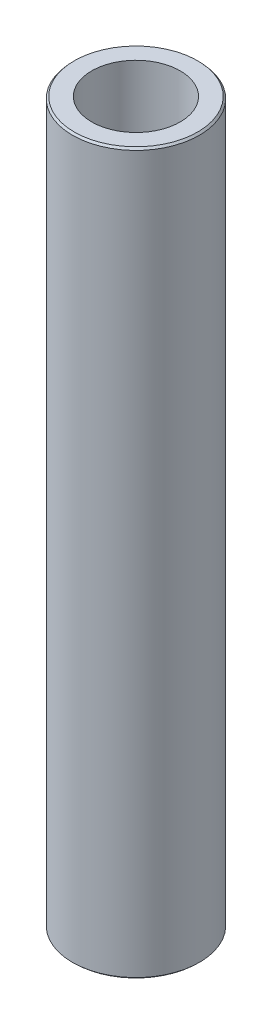
ISO-10303-21;
HEADER;
FILE_DESCRIPTION(('STEP AP214'),'2;1');
FILE_NAME('part.step','',(''),(''),'','','');
FILE_SCHEMA(('AUTOMOTIVE_DESIGN { 1 0 10303 214 1 1 1 1 }'));
ENDSEC;
DATA;
#1=APPLICATION_CONTEXT('core data for automotive mechanical design processes');
#2=APPLICATION_PROTOCOL_DEFINITION('international standard','automotive_design',2000,#1);
#3=PRODUCT_CONTEXT('',#1,'mechanical');
#4=PRODUCT('Part','Part','',(#3));
#5=PRODUCT_RELATED_PRODUCT_CATEGORY('part','',(#4));
#6=PRODUCT_DEFINITION_FORMATION('','',#4);
#7=PRODUCT_DEFINITION_CONTEXT('part definition',#1,'design');
#8=PRODUCT_DEFINITION('design','',#6,#7);
#9=PRODUCT_DEFINITION_SHAPE('','',#8);
#10=(LENGTH_UNIT() NAMED_UNIT(*) SI_UNIT(.MILLI.,.METRE.));
#11=(NAMED_UNIT(*) PLANE_ANGLE_UNIT() SI_UNIT($,.RADIAN.));
#12=(NAMED_UNIT(*) SI_UNIT($,.STERADIAN.) SOLID_ANGLE_UNIT());
#13=UNCERTAINTY_MEASURE_WITH_UNIT(LENGTH_MEASURE(1.E-05),#10,'distance_accuracy_value','');
#14=(GEOMETRIC_REPRESENTATION_CONTEXT(3) GLOBAL_UNCERTAINTY_ASSIGNED_CONTEXT((#13)) GLOBAL_UNIT_ASSIGNED_CONTEXT((#10,
#11,#12)) REPRESENTATION_CONTEXT('',''));
#15=CARTESIAN_POINT('',(0.,0.,0.));
#16=DIRECTION('',(0.,0.,1.));
#17=DIRECTION('',(1.,0.,0.));
#18=AXIS2_PLACEMENT_3D('',#15,#16,#17);
#19=CARTESIAN_POINT('',(0.,510.448634909969,0.));
#20=DIRECTION('',(0.,-1.,0.));
#21=DIRECTION('',(0.,0.,-1.));
#22=AXIS2_PLACEMENT_3D('',#19,#20,#21);
#23=CYLINDRICAL_SURFACE('',#22,45.);
#24=CARTESIAN_POINT('',(0.,509.078759082215,0.));
#25=DIRECTION('',(0.,1.,0.));
#26=DIRECTION('',(0.,0.,1.));
#27=AXIS2_PLACEMENT_3D('',#24,#25,#26);
#28=CIRCLE('',#27,45.);
#29=CARTESIAN_POINT('',(0.,509.078759082215,45.));
#30=VERTEX_POINT('',#29);
#31=EDGE_CURVE('E50',#30,#30,#28,.F.);
#32=ORIENTED_EDGE('',*,*,#31,.T.);
#33=EDGE_LOOP('',(#32));
#34=FACE_BOUND('',#33,.T.);
#35=CARTESIAN_POINT('',(0.,1.24590466142016,0.));
#36=DIRECTION('',(0.,1.,0.));
#37=DIRECTION('',(0.,0.,1.));
#38=AXIS2_PLACEMENT_3D('',#35,#36,#37);
#39=CIRCLE('',#38,45.);
#40=CARTESIAN_POINT('',(0.,1.24590466142016,45.));
#41=VERTEX_POINT('',#40);
#42=EDGE_CURVE('E51',#41,#41,#39,.T.);
#43=ORIENTED_EDGE('',*,*,#42,.T.);
#44=EDGE_LOOP('',(#43));
#45=FACE_BOUND('',#44,.T.);
#46=ADVANCED_FACE('F39',(#34,#45),#23,.T.);
#47=CARTESIAN_POINT('',(0.,510.448634909969,0.));
#48=DIRECTION('',(0.,1.,0.));
#49=DIRECTION('',(0.,0.,1.));
#50=AXIS2_PLACEMENT_3D('',#47,#48,#49);
#51=PLANE('',#50);
#52=CARTESIAN_POINT('',(0.,510.448634909969,0.));
#53=DIRECTION('',(0.,1.,0.));
#54=DIRECTION('',(0.,0.,1.));
#55=AXIS2_PLACEMENT_3D('',#52,#53,#54);
#56=CIRCLE('',#55,43.7540953385799);
#57=CARTESIAN_POINT('',(0.,510.448634909969,43.7540953385799));
#58=VERTEX_POINT('',#57);
#59=EDGE_CURVE('E54',#58,#58,#56,.T.);
#60=ORIENTED_EDGE('',*,*,#59,.T.);
#61=EDGE_LOOP('',(#60));
#62=FACE_BOUND('',#61,.T.);
#63=CARTESIAN_POINT('',(0.,510.448634909969,0.));
#64=DIRECTION('',(0.,1.,0.));
#65=DIRECTION('',(0.,0.,1.));
#66=AXIS2_PLACEMENT_3D('',#63,#64,#65);
#67=CIRCLE('',#66,31.3927188207862);
#68=CARTESIAN_POINT('',(0.,510.448634909969,31.3927188207862));
#69=VERTEX_POINT('',#68);
#70=EDGE_CURVE('E58',#69,#69,#67,.T.);
#71=ORIENTED_EDGE('',*,*,#70,.F.);
#72=EDGE_LOOP('',(#71));
#73=FACE_BOUND('',#72,.T.);
#74=ADVANCED_FACE('F69',(#62,#73),#51,.T.);
#75=CARTESIAN_POINT('',(0.,0.,0.));
#76=DIRECTION('',(0.,1.,0.));
#77=DIRECTION('',(0.,0.,1.));
#78=AXIS2_PLACEMENT_3D('',#75,#76,#77);
#79=PLANE('',#78);
#80=CARTESIAN_POINT('',(0.,0.,0.));
#81=DIRECTION('',(0.,1.,0.));
#82=DIRECTION('',(0.,0.,1.));
#83=AXIS2_PLACEMENT_3D('',#80,#81,#82);
#84=CIRCLE('',#83,43.6301241722467);
#85=CARTESIAN_POINT('',(0.,0.,43.6301241722467));
#86=VERTEX_POINT('',#85);
#87=EDGE_CURVE('E10',#86,#86,#84,.F.);
#88=ORIENTED_EDGE('',*,*,#87,.T.);
#89=EDGE_LOOP('',(#88));
#90=FACE_BOUND('',#89,.T.);
#91=CARTESIAN_POINT('',(0.,0.,0.));
#92=DIRECTION('',(0.,1.,0.));
#93=DIRECTION('',(0.,0.,1.));
#94=AXIS2_PLACEMENT_3D('',#91,#92,#93);
#95=CIRCLE('',#94,31.3927188207862);
#96=CARTESIAN_POINT('',(0.,0.,31.3927188207862));
#97=VERTEX_POINT('',#96);
#98=EDGE_CURVE('E63',#97,#97,#95,.T.);
#99=ORIENTED_EDGE('',*,*,#98,.T.);
#100=EDGE_LOOP('',(#99));
#101=FACE_BOUND('',#100,.T.);
#102=ADVANCED_FACE('F75',(#90,#101),#79,.F.);
#103=CARTESIAN_POINT('',(0.,510.448634909969,0.));
#104=DIRECTION('',(0.,-1.,0.));
#105=DIRECTION('',(0.,0.,-1.));
#106=AXIS2_PLACEMENT_3D('',#103,#104,#105);
#107=CYLINDRICAL_SURFACE('',#106,31.3927188207862);
#108=ORIENTED_EDGE('',*,*,#70,.T.);
#109=EDGE_LOOP('',(#108));
#110=FACE_BOUND('',#109,.T.);
#111=ORIENTED_EDGE('',*,*,#98,.F.);
#112=EDGE_LOOP('',(#111));
#113=FACE_BOUND('',#112,.T.);
#114=ADVANCED_FACE('F70',(#110,#113),#107,.F.);
#115=CARTESIAN_POINT('',(0.,510.448634909969,0.));
#116=DIRECTION('',(0.,-1.,0.));
#117=DIRECTION('',(0.,0.,-1.));
#118=AXIS2_PLACEMENT_3D('',#115,#116,#117);
#119=CONICAL_SURFACE('',#118,43.7540953385799,0.738040033595207);
#120=ORIENTED_EDGE('',*,*,#31,.F.);
#121=EDGE_LOOP('',(#120));
#122=FACE_BOUND('',#121,.T.);
#123=ORIENTED_EDGE('',*,*,#59,.F.);
#124=EDGE_LOOP('',(#123));
#125=FACE_BOUND('',#124,.T.);
#126=ADVANCED_FACE('F81',(#122,#125),#119,.T.);
#127=CARTESIAN_POINT('',(0.,1.24590466142016,0.));
#128=DIRECTION('',(0.,1.,0.));
#129=DIRECTION('',(0.,0.,1.));
#130=AXIS2_PLACEMENT_3D('',#127,#128,#129);
#131=CONICAL_SURFACE('',#130,45.,0.832756293199664);
#132=ORIENTED_EDGE('',*,*,#87,.F.);
#133=EDGE_LOOP('',(#132));
#134=FACE_BOUND('',#133,.T.);
#135=ORIENTED_EDGE('',*,*,#42,.F.);
#136=EDGE_LOOP('',(#135));
#137=FACE_BOUND('',#136,.T.);
#138=ADVANCED_FACE('F45',(#134,#137),#131,.T.);
#139=CLOSED_SHELL('',(#46,#74,#102,#114,#126,#138));
#140=MANIFOLD_SOLID_BREP('B2',#139);
#141=ADVANCED_BREP_SHAPE_REPRESENTATION('',(#18,#140),#14);
#142=SHAPE_DEFINITION_REPRESENTATION(#9,#141);
ENDSEC;
END-ISO-10303-21;
